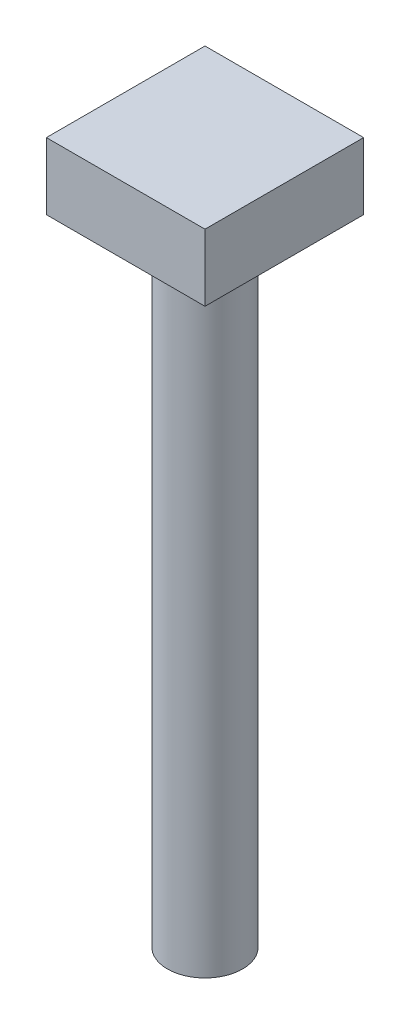
ISO-10303-21;
HEADER;
FILE_DESCRIPTION(('STEP AP214'),'2;1');
FILE_NAME('part.step','',(''),(''),'','','');
FILE_SCHEMA(('AUTOMOTIVE_DESIGN { 1 0 10303 214 1 1 1 1 }'));
ENDSEC;
DATA;
#1=APPLICATION_CONTEXT('core data for automotive mechanical design processes');
#2=APPLICATION_PROTOCOL_DEFINITION('international standard','automotive_design',2000,#1);
#3=PRODUCT_CONTEXT('',#1,'mechanical');
#4=PRODUCT('Part','Part','',(#3));
#5=PRODUCT_RELATED_PRODUCT_CATEGORY('part','',(#4));
#6=PRODUCT_DEFINITION_FORMATION('','',#4);
#7=PRODUCT_DEFINITION_CONTEXT('part definition',#1,'design');
#8=PRODUCT_DEFINITION('design','',#6,#7);
#9=PRODUCT_DEFINITION_SHAPE('','',#8);
#10=(LENGTH_UNIT() NAMED_UNIT(*) SI_UNIT(.MILLI.,.METRE.));
#11=(NAMED_UNIT(*) PLANE_ANGLE_UNIT() SI_UNIT($,.RADIAN.));
#12=(NAMED_UNIT(*) SI_UNIT($,.STERADIAN.) SOLID_ANGLE_UNIT());
#13=UNCERTAINTY_MEASURE_WITH_UNIT(LENGTH_MEASURE(1.E-05),#10,'distance_accuracy_value','');
#14=(GEOMETRIC_REPRESENTATION_CONTEXT(3) GLOBAL_UNCERTAINTY_ASSIGNED_CONTEXT((#13)) GLOBAL_UNIT_ASSIGNED_CONTEXT((#10,
#11,#12)) REPRESENTATION_CONTEXT('',''));
#15=CARTESIAN_POINT('',(0.,0.,0.));
#16=DIRECTION('',(0.,0.,1.));
#17=DIRECTION('',(1.,0.,0.));
#18=AXIS2_PLACEMENT_3D('',#15,#16,#17);
#19=CARTESIAN_POINT('',(9.5,8.,-9.5));
#20=DIRECTION('',(-1.,0.,0.));
#21=DIRECTION('',(0.,0.,1.));
#22=AXIS2_PLACEMENT_3D('',#19,#20,#21);
#23=PLANE('',#22);
#24=DIRECTION('',(0.,0.,-1.));
#25=VECTOR('',#24,1.);
#26=CARTESIAN_POINT('',(9.5,0.,-9.5));
#27=LINE('',#26,#25);
#28=CARTESIAN_POINT('',(9.5,0.,9.5));
#29=VERTEX_POINT('',#28);
#30=CARTESIAN_POINT('',(9.5,0.,-9.5));
#31=VERTEX_POINT('',#30);
#32=EDGE_CURVE('E96',#29,#31,#27,.T.);
#33=ORIENTED_EDGE('',*,*,#32,.T.);
#34=DIRECTION('',(0.,-1.,0.));
#35=VECTOR('',#34,1.);
#36=CARTESIAN_POINT('',(9.5,8.,-9.5));
#37=LINE('',#36,#35);
#38=CARTESIAN_POINT('',(9.5,8.,-9.5));
#39=VERTEX_POINT('',#38);
#40=EDGE_CURVE('E11',#39,#31,#37,.T.);
#41=ORIENTED_EDGE('',*,*,#40,.F.);
#42=DIRECTION('',(0.,0.,-1.));
#43=VECTOR('',#42,1.);
#44=CARTESIAN_POINT('',(9.5,8.,-9.5));
#45=LINE('',#44,#43);
#46=CARTESIAN_POINT('',(9.5,8.,9.5));
#47=VERTEX_POINT('',#46);
#48=EDGE_CURVE('E84',#47,#39,#45,.T.);
#49=ORIENTED_EDGE('',*,*,#48,.F.);
#50=DIRECTION('',(0.,-1.,0.));
#51=VECTOR('',#50,1.);
#52=CARTESIAN_POINT('',(9.5,8.,9.5));
#53=LINE('',#52,#51);
#54=EDGE_CURVE('E92',#47,#29,#53,.T.);
#55=ORIENTED_EDGE('',*,*,#54,.T.);
#56=EDGE_LOOP('',(#33,#41,#49,#55));
#57=FACE_BOUND('',#56,.T.);
#58=ADVANCED_FACE('F33',(#57),#23,.F.);
#59=CARTESIAN_POINT('',(-9.5,8.,-9.5));
#60=DIRECTION('',(0.,0.,1.));
#61=DIRECTION('',(1.,0.,0.));
#62=AXIS2_PLACEMENT_3D('',#59,#60,#61);
#63=PLANE('',#62);
#64=DIRECTION('',(-1.,0.,0.));
#65=VECTOR('',#64,1.);
#66=CARTESIAN_POINT('',(-9.5,0.,-9.5));
#67=LINE('',#66,#65);
#68=CARTESIAN_POINT('',(-9.5,0.,-9.5));
#69=VERTEX_POINT('',#68);
#70=EDGE_CURVE('E88',#31,#69,#67,.T.);
#71=ORIENTED_EDGE('',*,*,#70,.T.);
#72=DIRECTION('',(0.,-1.,0.));
#73=VECTOR('',#72,1.);
#74=CARTESIAN_POINT('',(-9.5,8.,-9.5));
#75=LINE('',#74,#73);
#76=CARTESIAN_POINT('',(-9.5,8.,-9.5));
#77=VERTEX_POINT('',#76);
#78=EDGE_CURVE('E41',#77,#69,#75,.T.);
#79=ORIENTED_EDGE('',*,*,#78,.F.);
#80=DIRECTION('',(-1.,0.,0.));
#81=VECTOR('',#80,1.);
#82=CARTESIAN_POINT('',(-9.5,8.,-9.5));
#83=LINE('',#82,#81);
#84=EDGE_CURVE('E79',#39,#77,#83,.T.);
#85=ORIENTED_EDGE('',*,*,#84,.F.);
#86=ORIENTED_EDGE('',*,*,#40,.T.);
#87=EDGE_LOOP('',(#71,#79,#85,#86));
#88=FACE_BOUND('',#87,.T.);
#89=ADVANCED_FACE('F87',(#88),#63,.F.);
#90=CARTESIAN_POINT('',(-9.5,8.,-9.5));
#91=DIRECTION('',(1.,0.,0.));
#92=DIRECTION('',(0.,0.,-1.));
#93=AXIS2_PLACEMENT_3D('',#90,#91,#92);
#94=PLANE('',#93);
#95=DIRECTION('',(0.,0.,1.));
#96=VECTOR('',#95,1.);
#97=CARTESIAN_POINT('',(-9.5,0.,-9.5));
#98=LINE('',#97,#96);
#99=CARTESIAN_POINT('',(-9.5,0.,9.5));
#100=VERTEX_POINT('',#99);
#101=EDGE_CURVE('E66',#69,#100,#98,.T.);
#102=ORIENTED_EDGE('',*,*,#101,.T.);
#103=DIRECTION('',(0.,-1.,0.));
#104=VECTOR('',#103,1.);
#105=CARTESIAN_POINT('',(-9.5,8.,9.5));
#106=LINE('',#105,#104);
#107=CARTESIAN_POINT('',(-9.5,8.,9.5));
#108=VERTEX_POINT('',#107);
#109=EDGE_CURVE('E89',#108,#100,#106,.T.);
#110=ORIENTED_EDGE('',*,*,#109,.F.);
#111=DIRECTION('',(0.,0.,1.));
#112=VECTOR('',#111,1.);
#113=CARTESIAN_POINT('',(-9.5,8.,-9.5));
#114=LINE('',#113,#112);
#115=EDGE_CURVE('E82',#77,#108,#114,.T.);
#116=ORIENTED_EDGE('',*,*,#115,.F.);
#117=ORIENTED_EDGE('',*,*,#78,.T.);
#118=EDGE_LOOP('',(#102,#110,#116,#117));
#119=FACE_BOUND('',#118,.T.);
#120=ADVANCED_FACE('F90',(#119),#94,.F.);
#121=CARTESIAN_POINT('',(-9.5,8.,9.5));
#122=DIRECTION('',(0.,0.,-1.));
#123=DIRECTION('',(-1.,0.,0.));
#124=AXIS2_PLACEMENT_3D('',#121,#122,#123);
#125=PLANE('',#124);
#126=DIRECTION('',(1.,0.,0.));
#127=VECTOR('',#126,1.);
#128=CARTESIAN_POINT('',(-9.5,0.,9.5));
#129=LINE('',#128,#127);
#130=EDGE_CURVE('E72',#100,#29,#129,.T.);
#131=ORIENTED_EDGE('',*,*,#130,.T.);
#132=ORIENTED_EDGE('',*,*,#54,.F.);
#133=DIRECTION('',(1.,0.,0.));
#134=VECTOR('',#133,1.);
#135=CARTESIAN_POINT('',(-9.5,8.,9.5));
#136=LINE('',#135,#134);
#137=EDGE_CURVE('E49',#108,#47,#136,.T.);
#138=ORIENTED_EDGE('',*,*,#137,.F.);
#139=ORIENTED_EDGE('',*,*,#109,.T.);
#140=EDGE_LOOP('',(#131,#132,#138,#139));
#141=FACE_BOUND('',#140,.T.);
#142=ADVANCED_FACE('F104',(#141),#125,.F.);
#143=CARTESIAN_POINT('',(0.,8.,0.));
#144=DIRECTION('',(0.,1.,0.));
#145=DIRECTION('',(0.,0.,1.));
#146=AXIS2_PLACEMENT_3D('',#143,#144,#145);
#147=PLANE('',#146);
#148=ORIENTED_EDGE('',*,*,#48,.T.);
#149=ORIENTED_EDGE('',*,*,#84,.T.);
#150=ORIENTED_EDGE('',*,*,#115,.T.);
#151=ORIENTED_EDGE('',*,*,#137,.T.);
#152=EDGE_LOOP('',(#148,#149,#150,#151));
#153=FACE_BOUND('',#152,.T.);
#154=ADVANCED_FACE('F80',(#153),#147,.T.);
#155=CARTESIAN_POINT('',(0.,0.,0.));
#156=DIRECTION('',(0.,1.,0.));
#157=DIRECTION('',(0.,0.,1.));
#158=AXIS2_PLACEMENT_3D('',#155,#156,#157);
#159=PLANE('',#158);
#160=CARTESIAN_POINT('',(0.,0.,0.));
#161=DIRECTION('',(0.,1.,0.));
#162=DIRECTION('',(0.,0.,1.));
#163=AXIS2_PLACEMENT_3D('',#160,#161,#162);
#164=CIRCLE('',#163,4.5);
#165=CARTESIAN_POINT('',(0.,0.,4.5));
#166=VERTEX_POINT('',#165);
#167=EDGE_CURVE('E110',#166,#166,#164,.T.);
#168=ORIENTED_EDGE('',*,*,#167,.T.);
#169=EDGE_LOOP('',(#168));
#170=FACE_BOUND('',#169,.T.);
#171=ORIENTED_EDGE('',*,*,#32,.F.);
#172=ORIENTED_EDGE('',*,*,#130,.F.);
#173=ORIENTED_EDGE('',*,*,#101,.F.);
#174=ORIENTED_EDGE('',*,*,#70,.F.);
#175=EDGE_LOOP('',(#171,#172,#173,#174));
#176=FACE_BOUND('',#175,.T.);
#177=ADVANCED_FACE('F107',(#170,#176),#159,.F.);
#178=CARTESIAN_POINT('',(0.,-76.,0.));
#179=DIRECTION('',(0.,1.,0.));
#180=DIRECTION('',(0.,0.,1.));
#181=AXIS2_PLACEMENT_3D('',#178,#179,#180);
#182=CYLINDRICAL_SURFACE('',#181,4.5);
#183=CARTESIAN_POINT('',(0.,-76.,0.));
#184=DIRECTION('',(0.,1.,0.));
#185=DIRECTION('',(0.,0.,1.));
#186=AXIS2_PLACEMENT_3D('',#183,#184,#185);
#187=CIRCLE('',#186,4.5);
#188=CARTESIAN_POINT('',(0.,-76.,4.5));
#189=VERTEX_POINT('',#188);
#190=EDGE_CURVE('E99',#189,#189,#187,.T.);
#191=ORIENTED_EDGE('',*,*,#190,.T.);
#192=EDGE_LOOP('',(#191));
#193=FACE_BOUND('',#192,.T.);
#194=ORIENTED_EDGE('',*,*,#167,.F.);
#195=EDGE_LOOP('',(#194));
#196=FACE_BOUND('',#195,.T.);
#197=ADVANCED_FACE('F116',(#193,#196),#182,.T.);
#198=CARTESIAN_POINT('',(0.,-76.,0.));
#199=DIRECTION('',(0.,1.,0.));
#200=DIRECTION('',(0.,0.,1.));
#201=AXIS2_PLACEMENT_3D('',#198,#199,#200);
#202=PLANE('',#201);
#203=ORIENTED_EDGE('',*,*,#190,.F.);
#204=EDGE_LOOP('',(#203));
#205=FACE_BOUND('',#204,.T.);
#206=ADVANCED_FACE('F119',(#205),#202,.F.);
#207=CLOSED_SHELL('',(#58,#89,#120,#142,#154,#177,#197,#206));
#208=MANIFOLD_SOLID_BREP('B2',#207);
#209=ADVANCED_BREP_SHAPE_REPRESENTATION('',(#18,#208),#14);
#210=SHAPE_DEFINITION_REPRESENTATION(#9,#209);
ENDSEC;
END-ISO-10303-21;
